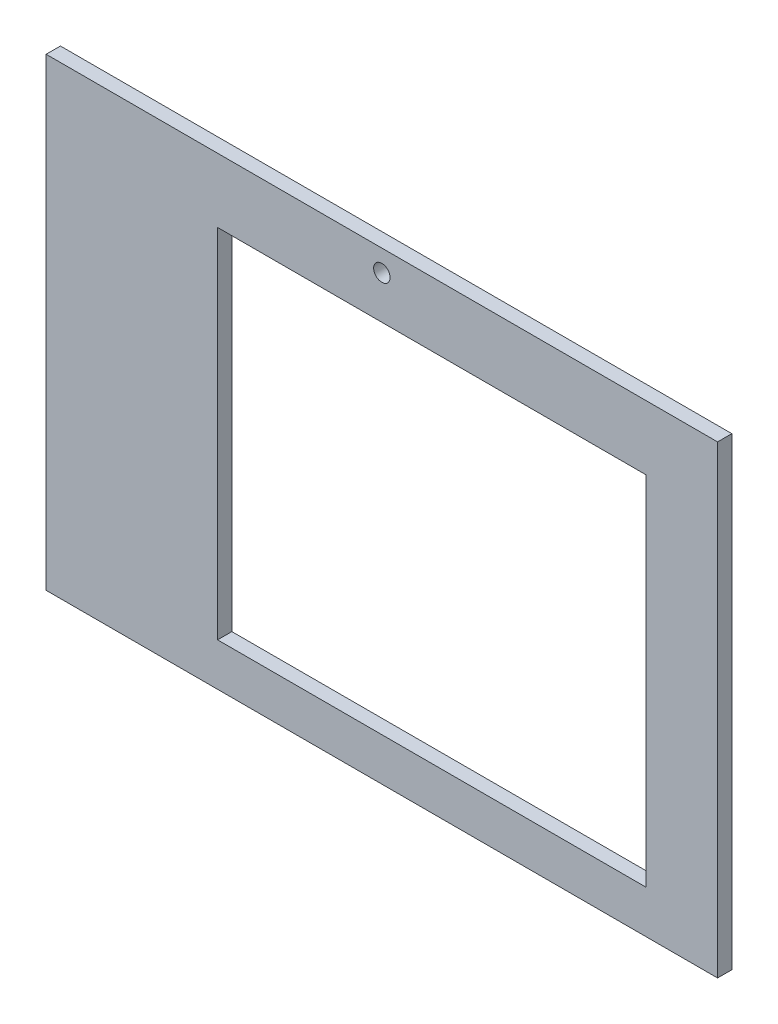
ISO-10303-21;
HEADER;
FILE_DESCRIPTION(('STEP AP214'),'2;1');
FILE_NAME('part.step','',(''),(''),'','','');
FILE_SCHEMA(('AUTOMOTIVE_DESIGN { 1 0 10303 214 1 1 1 1 }'));
ENDSEC;
DATA;
#1=APPLICATION_CONTEXT('core data for automotive mechanical design processes');
#2=APPLICATION_PROTOCOL_DEFINITION('international standard','automotive_design',2000,#1);
#3=PRODUCT_CONTEXT('',#1,'mechanical');
#4=PRODUCT('Part','Part','',(#3));
#5=PRODUCT_RELATED_PRODUCT_CATEGORY('part','',(#4));
#6=PRODUCT_DEFINITION_FORMATION('','',#4);
#7=PRODUCT_DEFINITION_CONTEXT('part definition',#1,'design');
#8=PRODUCT_DEFINITION('design','',#6,#7);
#9=PRODUCT_DEFINITION_SHAPE('','',#8);
#10=(LENGTH_UNIT() NAMED_UNIT(*) SI_UNIT(.MILLI.,.METRE.));
#11=(NAMED_UNIT(*) PLANE_ANGLE_UNIT() SI_UNIT($,.RADIAN.));
#12=(NAMED_UNIT(*) SI_UNIT($,.STERADIAN.) SOLID_ANGLE_UNIT());
#13=UNCERTAINTY_MEASURE_WITH_UNIT(LENGTH_MEASURE(1.E-05),#10,'distance_accuracy_value','');
#14=(GEOMETRIC_REPRESENTATION_CONTEXT(3) GLOBAL_UNCERTAINTY_ASSIGNED_CONTEXT((#13)) GLOBAL_UNIT_ASSIGNED_CONTEXT((#10,
#11,#12)) REPRESENTATION_CONTEXT('',''));
#15=CARTESIAN_POINT('',(0.,0.,0.));
#16=DIRECTION('',(0.,0.,1.));
#17=DIRECTION('',(1.,0.,0.));
#18=AXIS2_PLACEMENT_3D('',#15,#16,#17);
#19=CARTESIAN_POINT('',(-600.,-475.,20.));
#20=DIRECTION('',(0.,1.,0.));
#21=DIRECTION('',(0.,0.,1.));
#22=AXIS2_PLACEMENT_3D('',#19,#20,#21);
#23=PLANE('',#22);
#24=DIRECTION('',(1.,0.,0.));
#25=VECTOR('',#24,1.);
#26=CARTESIAN_POINT('',(-600.,-475.,20.));
#27=LINE('',#26,#25);
#28=CARTESIAN_POINT('',(-420.,-475.,20.));
#29=VERTEX_POINT('',#28);
#30=CARTESIAN_POINT('',(520.,-475.,20.));
#31=VERTEX_POINT('',#30);
#32=EDGE_CURVE('E43',#29,#31,#27,.T.);
#33=ORIENTED_EDGE('',*,*,#32,.F.);
#34=DIRECTION('',(0.,0.,-1.));
#35=VECTOR('',#34,1.);
#36=CARTESIAN_POINT('',(-420.,-475.,30.));
#37=LINE('',#36,#35);
#38=CARTESIAN_POINT('',(-420.,-475.,0.));
#39=VERTEX_POINT('',#38);
#40=EDGE_CURVE('E106',#29,#39,#37,.T.);
#41=ORIENTED_EDGE('',*,*,#40,.T.);
#42=DIRECTION('',(1.,0.,0.));
#43=VECTOR('',#42,1.);
#44=CARTESIAN_POINT('',(-600.,-475.,0.));
#45=LINE('',#44,#43);
#46=CARTESIAN_POINT('',(520.,-475.,0.));
#47=VERTEX_POINT('',#46);
#48=EDGE_CURVE('E114',#39,#47,#45,.T.);
#49=ORIENTED_EDGE('',*,*,#48,.T.);
#50=DIRECTION('',(0.,0.,-1.));
#51=VECTOR('',#50,1.);
#52=CARTESIAN_POINT('',(520.,-475.,30.));
#53=LINE('',#52,#51);
#54=EDGE_CURVE('E161',#31,#47,#53,.T.);
#55=ORIENTED_EDGE('',*,*,#54,.F.);
#56=EDGE_LOOP('',(#33,#41,#49,#55));
#57=FACE_BOUND('',#56,.T.);
#58=ADVANCED_FACE('F36',(#57),#23,.F.);
#59=CARTESIAN_POINT('',(0.,0.,20.));
#60=DIRECTION('',(0.,0.,-1.));
#61=DIRECTION('',(-1.,0.,0.));
#62=AXIS2_PLACEMENT_3D('',#59,#60,#61);
#63=PLANE('',#62);
#64=CARTESIAN_POINT('',(49.9999999999999,145.,20.));
#65=DIRECTION('',(0.,0.,-1.));
#66=DIRECTION('',(-1.,0.,0.));
#67=AXIS2_PLACEMENT_3D('',#64,#65,#66);
#68=CIRCLE('',#67,11.5);
#69=CARTESIAN_POINT('',(38.4999999999999,145.,20.));
#70=VERTEX_POINT('',#69);
#71=EDGE_CURVE('E118',#70,#70,#68,.T.);
#72=ORIENTED_EDGE('',*,*,#71,.T.);
#73=EDGE_LOOP('',(#72));
#74=FACE_BOUND('',#73,.T.);
#75=DIRECTION('',(1.,0.,0.));
#76=VECTOR('',#75,1.);
#77=CARTESIAN_POINT('',(420.,85.,20.));
#78=LINE('',#77,#76);
#79=CARTESIAN_POINT('',(-180.,85.,20.));
#80=VERTEX_POINT('',#79);
#81=CARTESIAN_POINT('',(420.,85.,20.));
#82=VERTEX_POINT('',#81);
#83=EDGE_CURVE('E137',#80,#82,#78,.T.);
#84=ORIENTED_EDGE('',*,*,#83,.T.);
#85=DIRECTION('',(0.,-1.,0.));
#86=VECTOR('',#85,1.);
#87=CARTESIAN_POINT('',(420.,-415.,20.));
#88=LINE('',#87,#86);
#89=CARTESIAN_POINT('',(420.,-415.,20.));
#90=VERTEX_POINT('',#89);
#91=EDGE_CURVE('E127',#82,#90,#88,.T.);
#92=ORIENTED_EDGE('',*,*,#91,.T.);
#93=DIRECTION('',(-1.,0.,0.));
#94=VECTOR('',#93,1.);
#95=CARTESIAN_POINT('',(420.,-415.,20.));
#96=LINE('',#95,#94);
#97=CARTESIAN_POINT('',(-180.,-415.,20.));
#98=VERTEX_POINT('',#97);
#99=EDGE_CURVE('E130',#90,#98,#96,.T.);
#100=ORIENTED_EDGE('',*,*,#99,.T.);
#101=DIRECTION('',(0.,1.,0.));
#102=VECTOR('',#101,1.);
#103=CARTESIAN_POINT('',(-180.,-415.,20.));
#104=LINE('',#103,#102);
#105=EDGE_CURVE('E134',#98,#80,#104,.T.);
#106=ORIENTED_EDGE('',*,*,#105,.T.);
#107=EDGE_LOOP('',(#84,#92,#100,#106));
#108=FACE_BOUND('',#107,.T.);
#109=DIRECTION('',(-1.,0.,0.));
#110=VECTOR('',#109,1.);
#111=CARTESIAN_POINT('',(0.,175.,20.));
#112=LINE('',#111,#110);
#113=CARTESIAN_POINT('',(520.,175.,20.));
#114=VERTEX_POINT('',#113);
#115=CARTESIAN_POINT('',(-420.,175.,20.));
#116=VERTEX_POINT('',#115);
#117=EDGE_CURVE('E117',#114,#116,#112,.T.);
#118=ORIENTED_EDGE('',*,*,#117,.T.);
#119=DIRECTION('',(0.,-1.,0.));
#120=VECTOR('',#119,1.);
#121=CARTESIAN_POINT('',(-420.,0.,20.));
#122=LINE('',#121,#120);
#123=EDGE_CURVE('E50',#116,#29,#122,.T.);
#124=ORIENTED_EDGE('',*,*,#123,.T.);
#125=ORIENTED_EDGE('',*,*,#32,.T.);
#126=DIRECTION('',(0.,1.,0.));
#127=VECTOR('',#126,1.);
#128=CARTESIAN_POINT('',(520.,0.,20.));
#129=LINE('',#128,#127);
#130=EDGE_CURVE('E165',#31,#114,#129,.T.);
#131=ORIENTED_EDGE('',*,*,#130,.T.);
#132=EDGE_LOOP('',(#118,#124,#125,#131));
#133=FACE_BOUND('',#132,.T.);
#134=ADVANCED_FACE('F178',(#74,#108,#133),#63,.F.);
#135=CARTESIAN_POINT('',(0.,0.,0.));
#136=DIRECTION('',(0.,0.,-1.));
#137=DIRECTION('',(-1.,0.,0.));
#138=AXIS2_PLACEMENT_3D('',#135,#136,#137);
#139=PLANE('',#138);
#140=DIRECTION('',(0.,-1.,0.));
#141=VECTOR('',#140,1.);
#142=CARTESIAN_POINT('',(-420.,-475.,0.));
#143=LINE('',#142,#141);
#144=CARTESIAN_POINT('',(-420.,175.,0.));
#145=VERTEX_POINT('',#144);
#146=EDGE_CURVE('E100',#145,#39,#143,.T.);
#147=ORIENTED_EDGE('',*,*,#146,.F.);
#148=DIRECTION('',(-1.,0.,0.));
#149=VECTOR('',#148,1.);
#150=CARTESIAN_POINT('',(600.,175.,0.));
#151=LINE('',#150,#149);
#152=CARTESIAN_POINT('',(520.,175.,0.));
#153=VERTEX_POINT('',#152);
#154=EDGE_CURVE('E113',#153,#145,#151,.T.);
#155=ORIENTED_EDGE('',*,*,#154,.F.);
#156=DIRECTION('',(0.,1.,0.));
#157=VECTOR('',#156,1.);
#158=CARTESIAN_POINT('',(520.,-475.,0.));
#159=LINE('',#158,#157);
#160=EDGE_CURVE('E58',#47,#153,#159,.T.);
#161=ORIENTED_EDGE('',*,*,#160,.F.);
#162=ORIENTED_EDGE('',*,*,#48,.F.);
#163=EDGE_LOOP('',(#147,#155,#161,#162));
#164=FACE_BOUND('',#163,.T.);
#165=CARTESIAN_POINT('',(49.9999999999999,145.,0.));
#166=DIRECTION('',(0.,0.,-1.));
#167=DIRECTION('',(-1.,0.,0.));
#168=AXIS2_PLACEMENT_3D('',#165,#166,#167);
#169=CIRCLE('',#168,11.5);
#170=CARTESIAN_POINT('',(38.4999999999999,145.,0.));
#171=VERTEX_POINT('',#170);
#172=EDGE_CURVE('E123',#171,#171,#169,.T.);
#173=ORIENTED_EDGE('',*,*,#172,.F.);
#174=EDGE_LOOP('',(#173));
#175=FACE_BOUND('',#174,.T.);
#176=DIRECTION('',(0.,-1.,0.));
#177=VECTOR('',#176,1.);
#178=CARTESIAN_POINT('',(420.,-415.,0.));
#179=LINE('',#178,#177);
#180=CARTESIAN_POINT('',(420.,85.,0.));
#181=VERTEX_POINT('',#180);
#182=CARTESIAN_POINT('',(420.,-415.,0.));
#183=VERTEX_POINT('',#182);
#184=EDGE_CURVE('E120',#181,#183,#179,.T.);
#185=ORIENTED_EDGE('',*,*,#184,.F.);
#186=DIRECTION('',(1.,0.,0.));
#187=VECTOR('',#186,1.);
#188=CARTESIAN_POINT('',(420.,85.,0.));
#189=LINE('',#188,#187);
#190=CARTESIAN_POINT('',(-180.,85.,0.));
#191=VERTEX_POINT('',#190);
#192=EDGE_CURVE('E131',#191,#181,#189,.T.);
#193=ORIENTED_EDGE('',*,*,#192,.F.);
#194=DIRECTION('',(0.,1.,0.));
#195=VECTOR('',#194,1.);
#196=CARTESIAN_POINT('',(-180.,-415.,0.));
#197=LINE('',#196,#195);
#198=CARTESIAN_POINT('',(-180.,-415.,0.));
#199=VERTEX_POINT('',#198);
#200=EDGE_CURVE('E145',#199,#191,#197,.T.);
#201=ORIENTED_EDGE('',*,*,#200,.F.);
#202=DIRECTION('',(-1.,0.,0.));
#203=VECTOR('',#202,1.);
#204=CARTESIAN_POINT('',(420.,-415.,0.));
#205=LINE('',#204,#203);
#206=EDGE_CURVE('E142',#183,#199,#205,.T.);
#207=ORIENTED_EDGE('',*,*,#206,.F.);
#208=EDGE_LOOP('',(#185,#193,#201,#207));
#209=FACE_BOUND('',#208,.T.);
#210=ADVANCED_FACE('F111',(#164,#175,#209),#139,.T.);
#211=CARTESIAN_POINT('',(420.,-415.,20.));
#212=DIRECTION('',(1.,0.,0.));
#213=DIRECTION('',(0.,0.,-1.));
#214=AXIS2_PLACEMENT_3D('',#211,#212,#213);
#215=PLANE('',#214);
#216=ORIENTED_EDGE('',*,*,#184,.T.);
#217=DIRECTION('',(0.,0.,-1.));
#218=VECTOR('',#217,1.);
#219=CARTESIAN_POINT('',(420.,-415.,20.));
#220=LINE('',#219,#218);
#221=EDGE_CURVE('E140',#90,#183,#220,.T.);
#222=ORIENTED_EDGE('',*,*,#221,.F.);
#223=ORIENTED_EDGE('',*,*,#91,.F.);
#224=DIRECTION('',(0.,0.,-1.));
#225=VECTOR('',#224,1.);
#226=CARTESIAN_POINT('',(420.,85.,20.));
#227=LINE('',#226,#225);
#228=EDGE_CURVE('E150',#82,#181,#227,.T.);
#229=ORIENTED_EDGE('',*,*,#228,.T.);
#230=EDGE_LOOP('',(#216,#222,#223,#229));
#231=FACE_BOUND('',#230,.T.);
#232=ADVANCED_FACE('F177',(#231),#215,.F.);
#233=CARTESIAN_POINT('',(420.,85.,20.));
#234=DIRECTION('',(0.,1.,0.));
#235=DIRECTION('',(0.,0.,1.));
#236=AXIS2_PLACEMENT_3D('',#233,#234,#235);
#237=PLANE('',#236);
#238=ORIENTED_EDGE('',*,*,#192,.T.);
#239=ORIENTED_EDGE('',*,*,#228,.F.);
#240=ORIENTED_EDGE('',*,*,#83,.F.);
#241=DIRECTION('',(0.,0.,-1.));
#242=VECTOR('',#241,1.);
#243=CARTESIAN_POINT('',(-180.,85.,20.));
#244=LINE('',#243,#242);
#245=EDGE_CURVE('E152',#80,#191,#244,.T.);
#246=ORIENTED_EDGE('',*,*,#245,.T.);
#247=EDGE_LOOP('',(#238,#239,#240,#246));
#248=FACE_BOUND('',#247,.T.);
#249=ADVANCED_FACE('F193',(#248),#237,.F.);
#250=CARTESIAN_POINT('',(-180.,-415.,20.));
#251=DIRECTION('',(-1.,0.,0.));
#252=DIRECTION('',(0.,0.,1.));
#253=AXIS2_PLACEMENT_3D('',#250,#251,#252);
#254=PLANE('',#253);
#255=ORIENTED_EDGE('',*,*,#200,.T.);
#256=ORIENTED_EDGE('',*,*,#245,.F.);
#257=ORIENTED_EDGE('',*,*,#105,.F.);
#258=DIRECTION('',(0.,0.,-1.));
#259=VECTOR('',#258,1.);
#260=CARTESIAN_POINT('',(-180.,-415.,20.));
#261=LINE('',#260,#259);
#262=EDGE_CURVE('E154',#98,#199,#261,.T.);
#263=ORIENTED_EDGE('',*,*,#262,.T.);
#264=EDGE_LOOP('',(#255,#256,#257,#263));
#265=FACE_BOUND('',#264,.T.);
#266=ADVANCED_FACE('F195',(#265),#254,.F.);
#267=CARTESIAN_POINT('',(420.,-415.,20.));
#268=DIRECTION('',(0.,-1.,0.));
#269=DIRECTION('',(1.,0.,0.));
#270=AXIS2_PLACEMENT_3D('',#267,#268,#269);
#271=PLANE('',#270);
#272=ORIENTED_EDGE('',*,*,#206,.T.);
#273=ORIENTED_EDGE('',*,*,#262,.F.);
#274=ORIENTED_EDGE('',*,*,#99,.F.);
#275=ORIENTED_EDGE('',*,*,#221,.T.);
#276=EDGE_LOOP('',(#272,#273,#274,#275));
#277=FACE_BOUND('',#276,.T.);
#278=ADVANCED_FACE('F187',(#277),#271,.F.);
#279=CARTESIAN_POINT('',(600.,175.,40.));
#280=DIRECTION('',(0.,-1.,0.));
#281=DIRECTION('',(1.,0.,0.));
#282=AXIS2_PLACEMENT_3D('',#279,#280,#281);
#283=PLANE('',#282);
#284=ORIENTED_EDGE('',*,*,#154,.T.);
#285=DIRECTION('',(0.,0.,-1.));
#286=VECTOR('',#285,1.);
#287=CARTESIAN_POINT('',(-420.,175.,30.));
#288=LINE('',#287,#286);
#289=EDGE_CURVE('E97',#116,#145,#288,.T.);
#290=ORIENTED_EDGE('',*,*,#289,.F.);
#291=ORIENTED_EDGE('',*,*,#117,.F.);
#292=DIRECTION('',(0.,0.,-1.));
#293=VECTOR('',#292,1.);
#294=CARTESIAN_POINT('',(520.,175.,40.));
#295=LINE('',#294,#293);
#296=EDGE_CURVE('E11',#114,#153,#295,.T.);
#297=ORIENTED_EDGE('',*,*,#296,.T.);
#298=EDGE_LOOP('',(#284,#290,#291,#297));
#299=FACE_BOUND('',#298,.T.);
#300=ADVANCED_FACE('F116',(#299),#283,.F.);
#301=CARTESIAN_POINT('',(49.9999999999999,145.,40.));
#302=DIRECTION('',(0.,0.,-1.));
#303=DIRECTION('',(-1.,0.,0.));
#304=AXIS2_PLACEMENT_3D('',#301,#302,#303);
#305=CYLINDRICAL_SURFACE('',#304,11.5);
#306=ORIENTED_EDGE('',*,*,#172,.T.);
#307=EDGE_LOOP('',(#306));
#308=FACE_BOUND('',#307,.T.);
#309=ORIENTED_EDGE('',*,*,#71,.F.);
#310=EDGE_LOOP('',(#309));
#311=FACE_BOUND('',#310,.T.);
#312=ADVANCED_FACE('F173',(#308,#311),#305,.F.);
#313=CARTESIAN_POINT('',(520.,-475.,30.));
#314=DIRECTION('',(-1.,0.,0.));
#315=DIRECTION('',(0.,0.,1.));
#316=AXIS2_PLACEMENT_3D('',#313,#314,#315);
#317=PLANE('',#316);
#318=ORIENTED_EDGE('',*,*,#54,.T.);
#319=ORIENTED_EDGE('',*,*,#160,.T.);
#320=ORIENTED_EDGE('',*,*,#296,.F.);
#321=ORIENTED_EDGE('',*,*,#130,.F.);
#322=EDGE_LOOP('',(#318,#319,#320,#321));
#323=FACE_BOUND('',#322,.T.);
#324=ADVANCED_FACE('F163',(#323),#317,.F.);
#325=CARTESIAN_POINT('',(-420.,-475.,30.));
#326=DIRECTION('',(1.,0.,0.));
#327=DIRECTION('',(0.,0.,-1.));
#328=AXIS2_PLACEMENT_3D('',#325,#326,#327);
#329=PLANE('',#328);
#330=ORIENTED_EDGE('',*,*,#289,.T.);
#331=ORIENTED_EDGE('',*,*,#146,.T.);
#332=ORIENTED_EDGE('',*,*,#40,.F.);
#333=ORIENTED_EDGE('',*,*,#123,.F.);
#334=EDGE_LOOP('',(#330,#331,#332,#333));
#335=FACE_BOUND('',#334,.T.);
#336=ADVANCED_FACE('F99',(#335),#329,.F.);
#337=CLOSED_SHELL('',(#58,#134,#210,#232,#249,#266,#278,#300,#312,#324,#336));
#338=MANIFOLD_SOLID_BREP('B2',#337);
#339=ADVANCED_BREP_SHAPE_REPRESENTATION('',(#18,#338),#14);
#340=SHAPE_DEFINITION_REPRESENTATION(#9,#339);
ENDSEC;
END-ISO-10303-21;
